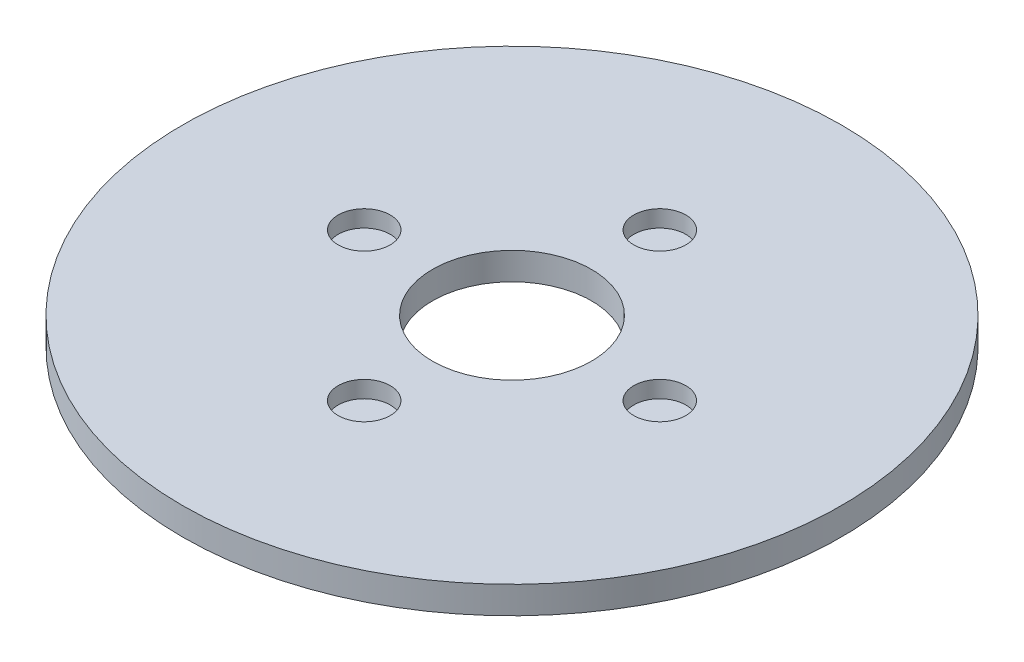
ISO-10303-21;
HEADER;
FILE_DESCRIPTION(('STEP AP214'),'2;1');
FILE_NAME('part.step','',(''),(''),'','','');
FILE_SCHEMA(('AUTOMOTIVE_DESIGN { 1 0 10303 214 1 1 1 1 }'));
ENDSEC;
DATA;
#1=APPLICATION_CONTEXT('core data for automotive mechanical design processes');
#2=APPLICATION_PROTOCOL_DEFINITION('international standard','automotive_design',2000,#1);
#3=PRODUCT_CONTEXT('',#1,'mechanical');
#4=PRODUCT('Part','Part','',(#3));
#5=PRODUCT_RELATED_PRODUCT_CATEGORY('part','',(#4));
#6=PRODUCT_DEFINITION_FORMATION('','',#4);
#7=PRODUCT_DEFINITION_CONTEXT('part definition',#1,'design');
#8=PRODUCT_DEFINITION('design','',#6,#7);
#9=PRODUCT_DEFINITION_SHAPE('','',#8);
#10=(LENGTH_UNIT() NAMED_UNIT(*) SI_UNIT(.MILLI.,.METRE.));
#11=(NAMED_UNIT(*) PLANE_ANGLE_UNIT() SI_UNIT($,.RADIAN.));
#12=(NAMED_UNIT(*) SI_UNIT($,.STERADIAN.) SOLID_ANGLE_UNIT());
#13=UNCERTAINTY_MEASURE_WITH_UNIT(LENGTH_MEASURE(1.E-05),#10,'distance_accuracy_value','');
#14=(GEOMETRIC_REPRESENTATION_CONTEXT(3) GLOBAL_UNCERTAINTY_ASSIGNED_CONTEXT((#13)) GLOBAL_UNIT_ASSIGNED_CONTEXT((#10,
#11,#12)) REPRESENTATION_CONTEXT('',''));
#15=CARTESIAN_POINT('',(0.,0.,0.));
#16=DIRECTION('',(0.,0.,1.));
#17=DIRECTION('',(1.,0.,0.));
#18=AXIS2_PLACEMENT_3D('',#15,#16,#17);
#19=CARTESIAN_POINT('',(0.,6.,0.));
#20=DIRECTION('',(0.,-1.,0.));
#21=DIRECTION('',(0.,0.,-1.));
#22=AXIS2_PLACEMENT_3D('',#19,#20,#21);
#23=CYLINDRICAL_SURFACE('',#22,72.5);
#24=CARTESIAN_POINT('',(0.,6.,0.));
#25=DIRECTION('',(0.,1.,0.));
#26=DIRECTION('',(0.,0.,1.));
#27=AXIS2_PLACEMENT_3D('',#24,#25,#26);
#28=CIRCLE('',#27,72.5);
#29=CARTESIAN_POINT('',(0.,6.,72.5));
#30=VERTEX_POINT('',#29);
#31=EDGE_CURVE('E10',#30,#30,#28,.T.);
#32=ORIENTED_EDGE('',*,*,#31,.F.);
#33=EDGE_LOOP('',(#32));
#34=FACE_BOUND('',#33,.T.);
#35=CARTESIAN_POINT('',(0.,0.,0.));
#36=DIRECTION('',(0.,1.,0.));
#37=DIRECTION('',(0.,0.,1.));
#38=AXIS2_PLACEMENT_3D('',#35,#36,#37);
#39=CIRCLE('',#38,72.5);
#40=CARTESIAN_POINT('',(0.,0.,72.5));
#41=VERTEX_POINT('',#40);
#42=EDGE_CURVE('E37',#41,#41,#39,.T.);
#43=ORIENTED_EDGE('',*,*,#42,.T.);
#44=EDGE_LOOP('',(#43));
#45=FACE_BOUND('',#44,.T.);
#46=ADVANCED_FACE('F40',(#34,#45),#23,.T.);
#47=CARTESIAN_POINT('',(0.,6.,0.));
#48=DIRECTION('',(0.,1.,0.));
#49=DIRECTION('',(0.,0.,1.));
#50=AXIS2_PLACEMENT_3D('',#47,#48,#49);
#51=PLANE('',#50);
#52=CARTESIAN_POINT('',(1.13525262251746E-13,6.,32.5149274002309));
#53=DIRECTION('',(0.,1.,0.));
#54=DIRECTION('',(1.,0.,0.));
#55=AXIS2_PLACEMENT_3D('',#52,#53,#54);
#56=CIRCLE('',#55,5.72100668178571);
#57=CARTESIAN_POINT('',(5.72100668178583,6.,32.5149274002309));
#58=VERTEX_POINT('',#57);
#59=EDGE_CURVE('E71',#58,#58,#56,.T.);
#60=ORIENTED_EDGE('',*,*,#59,.F.);
#61=EDGE_LOOP('',(#60));
#62=FACE_BOUND('',#61,.T.);
#63=CARTESIAN_POINT('',(32.5149274002309,6.,0.));
#64=DIRECTION('',(0.,1.,0.));
#65=DIRECTION('',(0.,0.,-1.));
#66=AXIS2_PLACEMENT_3D('',#63,#64,#65);
#67=CIRCLE('',#66,5.72100668178571);
#68=CARTESIAN_POINT('',(32.5149274002309,6.,-5.72100668178571));
#69=VERTEX_POINT('',#68);
#70=EDGE_CURVE('E70',#69,#69,#67,.T.);
#71=ORIENTED_EDGE('',*,*,#70,.F.);
#72=EDGE_LOOP('',(#71));
#73=FACE_BOUND('',#72,.T.);
#74=CARTESIAN_POINT('',(-3.40575786755237E-13,6.,-32.5149274002309));
#75=DIRECTION('',(0.,1.,0.));
#76=DIRECTION('',(-1.,0.,0.));
#77=AXIS2_PLACEMENT_3D('',#74,#75,#76);
#78=CIRCLE('',#77,5.72100668178571);
#79=CARTESIAN_POINT('',(-5.72100668178605,6.,-32.5149274002309));
#80=VERTEX_POINT('',#79);
#81=EDGE_CURVE('E61',#80,#80,#78,.T.);
#82=ORIENTED_EDGE('',*,*,#81,.F.);
#83=EDGE_LOOP('',(#82));
#84=FACE_BOUND('',#83,.T.);
#85=CARTESIAN_POINT('',(-32.5149274002309,6.,0.));
#86=DIRECTION('',(0.,1.,0.));
#87=DIRECTION('',(0.,0.,1.));
#88=AXIS2_PLACEMENT_3D('',#85,#86,#87);
#89=CIRCLE('',#88,5.72100668178571);
#90=CARTESIAN_POINT('',(-32.5149274002309,6.,5.72100668178571));
#91=VERTEX_POINT('',#90);
#92=EDGE_CURVE('E54',#91,#91,#89,.T.);
#93=ORIENTED_EDGE('',*,*,#92,.F.);
#94=EDGE_LOOP('',(#93));
#95=FACE_BOUND('',#94,.T.);
#96=CARTESIAN_POINT('',(0.,6.,0.));
#97=DIRECTION('',(0.,1.,0.));
#98=DIRECTION('',(0.,0.,1.));
#99=AXIS2_PLACEMENT_3D('',#96,#97,#98);
#100=CIRCLE('',#99,17.5);
#101=CARTESIAN_POINT('',(0.,6.,17.5));
#102=VERTEX_POINT('',#101);
#103=EDGE_CURVE('E50',#102,#102,#100,.T.);
#104=ORIENTED_EDGE('',*,*,#103,.F.);
#105=EDGE_LOOP('',(#104));
#106=FACE_BOUND('',#105,.T.);
#107=ORIENTED_EDGE('',*,*,#31,.T.);
#108=EDGE_LOOP('',(#107));
#109=FACE_BOUND('',#108,.T.);
#110=ADVANCED_FACE('F86',(#62,#73,#84,#95,#106,#109),#51,.T.);
#111=CARTESIAN_POINT('',(0.,0.,0.));
#112=DIRECTION('',(0.,1.,0.));
#113=DIRECTION('',(0.,0.,1.));
#114=AXIS2_PLACEMENT_3D('',#111,#112,#113);
#115=PLANE('',#114);
#116=CARTESIAN_POINT('',(0.,0.,0.));
#117=DIRECTION('',(0.,1.,0.));
#118=DIRECTION('',(0.,0.,1.));
#119=AXIS2_PLACEMENT_3D('',#116,#117,#118);
#120=CIRCLE('',#119,17.5);
#121=CARTESIAN_POINT('',(0.,0.,17.5));
#122=VERTEX_POINT('',#121);
#123=EDGE_CURVE('E47',#122,#122,#120,.T.);
#124=ORIENTED_EDGE('',*,*,#123,.T.);
#125=EDGE_LOOP('',(#124));
#126=FACE_BOUND('',#125,.T.);
#127=ORIENTED_EDGE('',*,*,#42,.F.);
#128=EDGE_LOOP('',(#127));
#129=FACE_BOUND('',#128,.T.);
#130=ADVANCED_FACE('F93',(#126,#129),#115,.F.);
#131=CARTESIAN_POINT('',(0.,6.,0.));
#132=DIRECTION('',(0.,-1.,0.));
#133=DIRECTION('',(0.,0.,-1.));
#134=AXIS2_PLACEMENT_3D('',#131,#132,#133);
#135=CYLINDRICAL_SURFACE('',#134,17.5);
#136=ORIENTED_EDGE('',*,*,#103,.T.);
#137=EDGE_LOOP('',(#136));
#138=FACE_BOUND('',#137,.T.);
#139=ORIENTED_EDGE('',*,*,#123,.F.);
#140=EDGE_LOOP('',(#139));
#141=FACE_BOUND('',#140,.T.);
#142=ADVANCED_FACE('F101',(#138,#141),#135,.F.);
#143=CARTESIAN_POINT('',(-32.5149274002309,2.30535964800834,0.));
#144=DIRECTION('',(0.,1.,0.));
#145=DIRECTION('',(0.,0.,1.));
#146=AXIS2_PLACEMENT_3D('',#143,#144,#145);
#147=CYLINDRICAL_SURFACE('',#146,5.72100668178571);
#148=CARTESIAN_POINT('',(-32.5149274002309,2.30535964800834,0.));
#149=DIRECTION('',(0.,1.,0.));
#150=DIRECTION('',(0.,0.,1.));
#151=AXIS2_PLACEMENT_3D('',#148,#149,#150);
#152=CIRCLE('',#151,5.72100668178571);
#153=CARTESIAN_POINT('',(-32.5149274002309,2.30535964800834,5.72100668178571));
#154=VERTEX_POINT('',#153);
#155=EDGE_CURVE('E55',#154,#154,#152,.T.);
#156=ORIENTED_EDGE('',*,*,#155,.F.);
#157=EDGE_LOOP('',(#156));
#158=FACE_BOUND('',#157,.T.);
#159=ORIENTED_EDGE('',*,*,#92,.T.);
#160=EDGE_LOOP('',(#159));
#161=FACE_BOUND('',#160,.T.);
#162=ADVANCED_FACE('F102',(#158,#161),#147,.F.);
#163=CARTESIAN_POINT('',(-32.5149274002309,2.30535964800834,0.));
#164=DIRECTION('',(0.,1.,0.));
#165=DIRECTION('',(0.,0.,1.));
#166=AXIS2_PLACEMENT_3D('',#163,#164,#165);
#167=PLANE('',#166);
#168=ORIENTED_EDGE('',*,*,#155,.T.);
#169=EDGE_LOOP('',(#168));
#170=FACE_BOUND('',#169,.T.);
#171=ADVANCED_FACE('F133',(#170),#167,.T.);
#172=CARTESIAN_POINT('',(-3.40575786755237E-13,2.30535964800834,-32.5149274002309));
#173=DIRECTION('',(0.,1.,0.));
#174=DIRECTION('',(0.,0.,1.));
#175=AXIS2_PLACEMENT_3D('',#172,#173,#174);
#176=CYLINDRICAL_SURFACE('',#175,5.72100668178571);
#177=CARTESIAN_POINT('',(-3.40575786755237E-13,2.30535964800834,-32.5149274002309));
#178=DIRECTION('',(0.,1.,0.));
#179=DIRECTION('',(-1.,0.,0.));
#180=AXIS2_PLACEMENT_3D('',#177,#178,#179);
#181=CIRCLE('',#180,5.72100668178571);
#182=CARTESIAN_POINT('',(-5.72100668178605,2.30535964800834,-32.5149274002309));
#183=VERTEX_POINT('',#182);
#184=EDGE_CURVE('E63',#183,#183,#181,.T.);
#185=ORIENTED_EDGE('',*,*,#184,.F.);
#186=EDGE_LOOP('',(#185));
#187=FACE_BOUND('',#186,.T.);
#188=ORIENTED_EDGE('',*,*,#81,.T.);
#189=EDGE_LOOP('',(#188));
#190=FACE_BOUND('',#189,.T.);
#191=ADVANCED_FACE('F142',(#187,#190),#176,.F.);
#192=CARTESIAN_POINT('',(-3.40575786755237E-13,2.30535964800834,-32.5149274002309));
#193=DIRECTION('',(0.,1.,0.));
#194=DIRECTION('',(-1.,0.,0.));
#195=AXIS2_PLACEMENT_3D('',#192,#193,#194);
#196=PLANE('',#195);
#197=ORIENTED_EDGE('',*,*,#184,.T.);
#198=EDGE_LOOP('',(#197));
#199=FACE_BOUND('',#198,.T.);
#200=ADVANCED_FACE('F156',(#199),#196,.T.);
#201=CARTESIAN_POINT('',(32.5149274002309,2.30535964800834,0.));
#202=DIRECTION('',(0.,1.,0.));
#203=DIRECTION('',(0.,0.,1.));
#204=AXIS2_PLACEMENT_3D('',#201,#202,#203);
#205=CYLINDRICAL_SURFACE('',#204,5.72100668178571);
#206=CARTESIAN_POINT('',(32.5149274002309,2.30535964800834,0.));
#207=DIRECTION('',(0.,1.,0.));
#208=DIRECTION('',(0.,0.,-1.));
#209=AXIS2_PLACEMENT_3D('',#206,#207,#208);
#210=CIRCLE('',#209,5.72100668178571);
#211=CARTESIAN_POINT('',(32.5149274002309,2.30535964800834,-5.72100668178571));
#212=VERTEX_POINT('',#211);
#213=EDGE_CURVE('E69',#212,#212,#210,.T.);
#214=ORIENTED_EDGE('',*,*,#213,.F.);
#215=EDGE_LOOP('',(#214));
#216=FACE_BOUND('',#215,.T.);
#217=ORIENTED_EDGE('',*,*,#70,.T.);
#218=EDGE_LOOP('',(#217));
#219=FACE_BOUND('',#218,.T.);
#220=ADVANCED_FACE('F164',(#216,#219),#205,.F.);
#221=CARTESIAN_POINT('',(32.5149274002309,2.30535964800834,0.));
#222=DIRECTION('',(0.,1.,0.));
#223=DIRECTION('',(0.,0.,-1.));
#224=AXIS2_PLACEMENT_3D('',#221,#222,#223);
#225=PLANE('',#224);
#226=ORIENTED_EDGE('',*,*,#213,.T.);
#227=EDGE_LOOP('',(#226));
#228=FACE_BOUND('',#227,.T.);
#229=ADVANCED_FACE('F83',(#228),#225,.T.);
#230=CARTESIAN_POINT('',(1.13525262251746E-13,2.30535964800834,32.5149274002309));
#231=DIRECTION('',(0.,1.,0.));
#232=DIRECTION('',(0.,0.,1.));
#233=AXIS2_PLACEMENT_3D('',#230,#231,#232);
#234=CYLINDRICAL_SURFACE('',#233,5.72100668178571);
#235=CARTESIAN_POINT('',(1.13525262251746E-13,2.30535964800834,32.5149274002309));
#236=DIRECTION('',(0.,1.,0.));
#237=DIRECTION('',(1.,0.,0.));
#238=AXIS2_PLACEMENT_3D('',#235,#236,#237);
#239=CIRCLE('',#238,5.72100668178571);
#240=CARTESIAN_POINT('',(5.72100668178583,2.30535964800834,32.5149274002309));
#241=VERTEX_POINT('',#240);
#242=EDGE_CURVE('E59',#241,#241,#239,.T.);
#243=ORIENTED_EDGE('',*,*,#242,.F.);
#244=EDGE_LOOP('',(#243));
#245=FACE_BOUND('',#244,.T.);
#246=ORIENTED_EDGE('',*,*,#59,.T.);
#247=EDGE_LOOP('',(#246));
#248=FACE_BOUND('',#247,.T.);
#249=ADVANCED_FACE('F81',(#245,#248),#234,.F.);
#250=CARTESIAN_POINT('',(1.13525262251746E-13,2.30535964800834,32.5149274002309));
#251=DIRECTION('',(0.,1.,0.));
#252=DIRECTION('',(1.,0.,0.));
#253=AXIS2_PLACEMENT_3D('',#250,#251,#252);
#254=PLANE('',#253);
#255=ORIENTED_EDGE('',*,*,#242,.T.);
#256=EDGE_LOOP('',(#255));
#257=FACE_BOUND('',#256,.T.);
#258=ADVANCED_FACE('F78',(#257),#254,.T.);
#259=CLOSED_SHELL('',(#46,#110,#130,#142,#162,#171,#191,#200,#220,#229,#249,#258));
#260=MANIFOLD_SOLID_BREP('B2',#259);
#261=ADVANCED_BREP_SHAPE_REPRESENTATION('',(#18,#260),#14);
#262=SHAPE_DEFINITION_REPRESENTATION(#9,#261);
ENDSEC;
END-ISO-10303-21;
